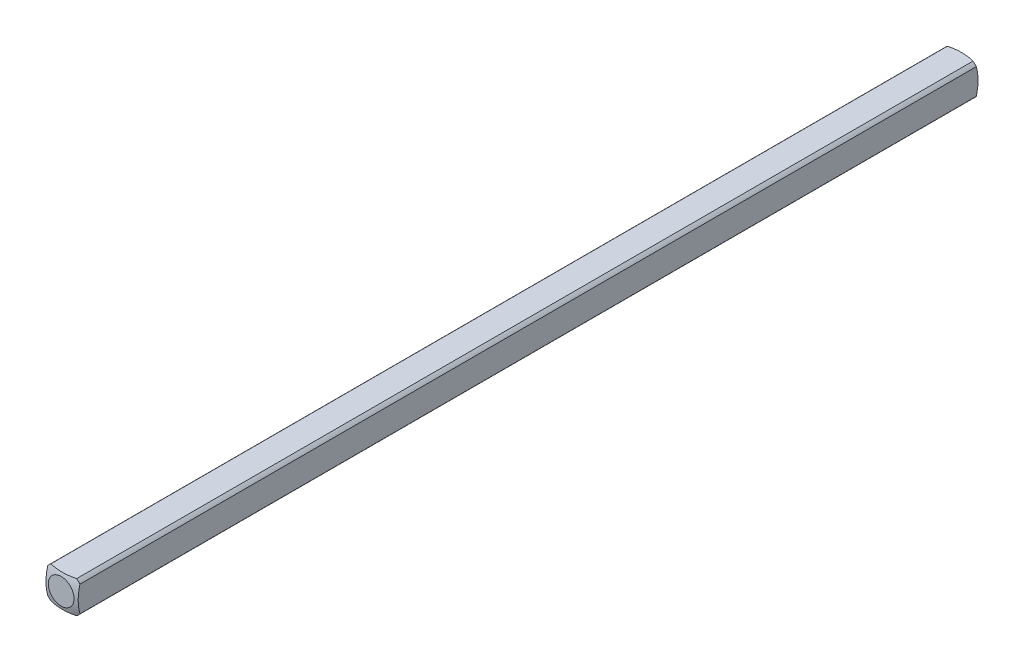
ISO-10303-21;
HEADER;
FILE_DESCRIPTION(('STEP AP214'),'2;1');
FILE_NAME('part.step','',(''),(''),'','','');
FILE_SCHEMA(('AUTOMOTIVE_DESIGN { 1 0 10303 214 1 1 1 1 }'));
ENDSEC;
DATA;
#1=APPLICATION_CONTEXT('core data for automotive mechanical design processes');
#2=APPLICATION_PROTOCOL_DEFINITION('international standard','automotive_design',2000,#1);
#3=PRODUCT_CONTEXT('',#1,'mechanical');
#4=PRODUCT('Part','Part','',(#3));
#5=PRODUCT_RELATED_PRODUCT_CATEGORY('part','',(#4));
#6=PRODUCT_DEFINITION_FORMATION('','',#4);
#7=PRODUCT_DEFINITION_CONTEXT('part definition',#1,'design');
#8=PRODUCT_DEFINITION('design','',#6,#7);
#9=PRODUCT_DEFINITION_SHAPE('','',#8);
#10=(LENGTH_UNIT() NAMED_UNIT(*) SI_UNIT(.MILLI.,.METRE.));
#11=(NAMED_UNIT(*) PLANE_ANGLE_UNIT() SI_UNIT($,.RADIAN.));
#12=(NAMED_UNIT(*) SI_UNIT($,.STERADIAN.) SOLID_ANGLE_UNIT());
#13=UNCERTAINTY_MEASURE_WITH_UNIT(LENGTH_MEASURE(1.E-05),#10,'distance_accuracy_value','');
#14=(GEOMETRIC_REPRESENTATION_CONTEXT(3) GLOBAL_UNCERTAINTY_ASSIGNED_CONTEXT((#13)) GLOBAL_UNIT_ASSIGNED_CONTEXT((#10,
#11,#12)) REPRESENTATION_CONTEXT('',''));
#15=CARTESIAN_POINT('',(0.,0.,0.));
#16=DIRECTION('',(0.,0.,1.));
#17=DIRECTION('',(1.,0.,0.));
#18=AXIS2_PLACEMENT_3D('',#15,#16,#17);
#19=CARTESIAN_POINT('',(-1.5875,-1.5875,44.45));
#20=DIRECTION('',(1.,0.,0.));
#21=DIRECTION('',(0.,0.,-1.));
#22=AXIS2_PLACEMENT_3D('',#19,#20,#21);
#23=PLANE('',#22);
#24=CARTESIAN_POINT('',(-1.5875,0.,4.91912226376204));
#25=DIRECTION('',(1.,0.,0.));
#26=DIRECTION('',(0.,0.,-1.));
#27=AXIS2_PLACEMENT_3D('',#24,#25,#26);
#28=CIRCLE('',#27,4.82558221875869);
#29=CARTESIAN_POINT('',(-1.5875,-1.26841150657032,0.263225357686904));
#30=VERTEX_POINT('',#29);
#31=CARTESIAN_POINT('',(-1.5875,1.26841150657032,0.263225357686907));
#32=VERTEX_POINT('',#31);
#33=EDGE_CURVE('E55',#30,#32,#28,.T.);
#34=ORIENTED_EDGE('',*,*,#33,.F.);
#35=DIRECTION('',(0.,0.,-1.));
#36=VECTOR('',#35,1.);
#37=CARTESIAN_POINT('',(-1.5875,-1.26841150657032,44.45));
#38=LINE('',#37,#36);
#39=CARTESIAN_POINT('',(-1.5875,-1.26841150657032,88.6367746423131));
#40=VERTEX_POINT('',#39);
#41=EDGE_CURVE('E48',#40,#30,#38,.T.);
#42=ORIENTED_EDGE('',*,*,#41,.F.);
#43=CARTESIAN_POINT('',(-1.5875,0.,83.980877736238));
#44=DIRECTION('',(-1.,0.,0.));
#45=DIRECTION('',(0.,0.,1.));
#46=AXIS2_PLACEMENT_3D('',#43,#44,#45);
#47=CIRCLE('',#46,4.82558221875869);
#48=CARTESIAN_POINT('',(-1.5875,1.26841150657032,88.6367746423131));
#49=VERTEX_POINT('',#48);
#50=EDGE_CURVE('E134',#40,#49,#47,.T.);
#51=ORIENTED_EDGE('',*,*,#50,.T.);
#52=DIRECTION('',(0.,0.,-1.));
#53=VECTOR('',#52,1.);
#54=CARTESIAN_POINT('',(-1.5875,1.26841150657032,44.45));
#55=LINE('',#54,#53);
#56=EDGE_CURVE('E120',#32,#49,#55,.F.);
#57=ORIENTED_EDGE('',*,*,#56,.F.);
#58=EDGE_LOOP('',(#34,#42,#51,#57));
#59=FACE_BOUND('',#58,.T.);
#60=ADVANCED_FACE('F40',(#59),#23,.F.);
#61=CARTESIAN_POINT('',(-1.5875,-1.5875,44.45));
#62=DIRECTION('',(0.,1.,0.));
#63=DIRECTION('',(0.,0.,1.));
#64=AXIS2_PLACEMENT_3D('',#61,#62,#63);
#65=PLANE('',#64);
#66=CARTESIAN_POINT('',(0.,-1.5875,4.91912226376204));
#67=DIRECTION('',(0.,1.,0.));
#68=DIRECTION('',(0.,0.,1.));
#69=AXIS2_PLACEMENT_3D('',#66,#67,#68);
#70=CIRCLE('',#69,4.82558221875869);
#71=CARTESIAN_POINT('',(1.26841150657032,-1.5875,0.263225357686905));
#72=VERTEX_POINT('',#71);
#73=CARTESIAN_POINT('',(-1.26841150657032,-1.5875,0.263225357686904));
#74=VERTEX_POINT('',#73);
#75=EDGE_CURVE('E175',#72,#74,#70,.T.);
#76=ORIENTED_EDGE('',*,*,#75,.F.);
#77=DIRECTION('',(0.,0.,-1.));
#78=VECTOR('',#77,1.);
#79=CARTESIAN_POINT('',(1.26841150657032,-1.5875,44.45));
#80=LINE('',#79,#78);
#81=CARTESIAN_POINT('',(1.26841150657032,-1.5875,88.6367746423131));
#82=VERTEX_POINT('',#81);
#83=EDGE_CURVE('E195',#82,#72,#80,.T.);
#84=ORIENTED_EDGE('',*,*,#83,.F.);
#85=CARTESIAN_POINT('',(0.,-1.5875,83.980877736238));
#86=DIRECTION('',(0.,-1.,0.));
#87=DIRECTION('',(0.,0.,-1.));
#88=AXIS2_PLACEMENT_3D('',#85,#86,#87);
#89=CIRCLE('',#88,4.82558221875869);
#90=CARTESIAN_POINT('',(-1.26841150657032,-1.5875,88.6367746423131));
#91=VERTEX_POINT('',#90);
#92=EDGE_CURVE('E149',#82,#91,#89,.T.);
#93=ORIENTED_EDGE('',*,*,#92,.T.);
#94=DIRECTION('',(0.,0.,-1.));
#95=VECTOR('',#94,1.);
#96=CARTESIAN_POINT('',(-1.26841150657032,-1.5875,44.45));
#97=LINE('',#96,#95);
#98=EDGE_CURVE('E192',#74,#91,#97,.F.);
#99=ORIENTED_EDGE('',*,*,#98,.F.);
#100=EDGE_LOOP('',(#76,#84,#93,#99));
#101=FACE_BOUND('',#100,.T.);
#102=ADVANCED_FACE('F208',(#101),#65,.F.);
#103=CARTESIAN_POINT('',(1.5875,-1.5875,44.45));
#104=DIRECTION('',(-1.,0.,0.));
#105=DIRECTION('',(0.,0.,1.));
#106=AXIS2_PLACEMENT_3D('',#103,#104,#105);
#107=PLANE('',#106);
#108=CARTESIAN_POINT('',(1.5875,0.,4.91912226376204));
#109=DIRECTION('',(-1.,0.,0.));
#110=DIRECTION('',(0.,0.,1.));
#111=AXIS2_PLACEMENT_3D('',#108,#109,#110);
#112=CIRCLE('',#111,4.82558221875869);
#113=CARTESIAN_POINT('',(1.5875,1.26841150657032,0.263225357686904));
#114=VERTEX_POINT('',#113);
#115=CARTESIAN_POINT('',(1.5875,-1.26841150657032,0.263225357686904));
#116=VERTEX_POINT('',#115);
#117=EDGE_CURVE('E172',#114,#116,#112,.T.);
#118=ORIENTED_EDGE('',*,*,#117,.F.);
#119=DIRECTION('',(0.,0.,-1.));
#120=VECTOR('',#119,1.);
#121=CARTESIAN_POINT('',(1.5875,1.26841150657032,44.45));
#122=LINE('',#121,#120);
#123=CARTESIAN_POINT('',(1.5875,1.26841150657032,88.6367746423131));
#124=VERTEX_POINT('',#123);
#125=EDGE_CURVE('E188',#124,#114,#122,.T.);
#126=ORIENTED_EDGE('',*,*,#125,.F.);
#127=CARTESIAN_POINT('',(1.5875,0.,83.980877736238));
#128=DIRECTION('',(1.,0.,0.));
#129=DIRECTION('',(0.,0.,-1.));
#130=AXIS2_PLACEMENT_3D('',#127,#128,#129);
#131=CIRCLE('',#130,4.82558221875869);
#132=CARTESIAN_POINT('',(1.5875,-1.26841150657032,88.6367746423131));
#133=VERTEX_POINT('',#132);
#134=EDGE_CURVE('E145',#124,#133,#131,.T.);
#135=ORIENTED_EDGE('',*,*,#134,.T.);
#136=DIRECTION('',(0.,0.,-1.));
#137=VECTOR('',#136,1.);
#138=CARTESIAN_POINT('',(1.5875,-1.26841150657032,44.45));
#139=LINE('',#138,#137);
#140=EDGE_CURVE('E113',#116,#133,#139,.F.);
#141=ORIENTED_EDGE('',*,*,#140,.F.);
#142=EDGE_LOOP('',(#118,#126,#135,#141));
#143=FACE_BOUND('',#142,.T.);
#144=ADVANCED_FACE('F215',(#143),#107,.F.);
#145=CARTESIAN_POINT('',(-1.5875,1.5875,44.45));
#146=DIRECTION('',(0.,-1.,0.));
#147=DIRECTION('',(0.,0.,-1.));
#148=AXIS2_PLACEMENT_3D('',#145,#146,#147);
#149=PLANE('',#148);
#150=CARTESIAN_POINT('',(0.,1.5875,4.91912226376204));
#151=DIRECTION('',(0.,-1.,0.));
#152=DIRECTION('',(0.,0.,-1.));
#153=AXIS2_PLACEMENT_3D('',#150,#151,#152);
#154=CIRCLE('',#153,4.82558221875869);
#155=CARTESIAN_POINT('',(-1.26841150657032,1.5875,0.263225357686904));
#156=VERTEX_POINT('',#155);
#157=CARTESIAN_POINT('',(1.26841150657032,1.5875,0.263225357686904));
#158=VERTEX_POINT('',#157);
#159=EDGE_CURVE('E110',#156,#158,#154,.T.);
#160=ORIENTED_EDGE('',*,*,#159,.F.);
#161=DIRECTION('',(0.,0.,-1.));
#162=VECTOR('',#161,1.);
#163=CARTESIAN_POINT('',(-1.26841150657032,1.5875,44.45));
#164=LINE('',#163,#162);
#165=CARTESIAN_POINT('',(-1.26841150657032,1.5875,88.6367746423131));
#166=VERTEX_POINT('',#165);
#167=EDGE_CURVE('E104',#166,#156,#164,.T.);
#168=ORIENTED_EDGE('',*,*,#167,.F.);
#169=CARTESIAN_POINT('',(0.,1.5875,83.980877736238));
#170=DIRECTION('',(0.,1.,0.));
#171=DIRECTION('',(0.,0.,1.));
#172=AXIS2_PLACEMENT_3D('',#169,#170,#171);
#173=CIRCLE('',#172,4.82558221875869);
#174=CARTESIAN_POINT('',(1.26841150657032,1.5875,88.6367746423131));
#175=VERTEX_POINT('',#174);
#176=EDGE_CURVE('E109',#166,#175,#173,.T.);
#177=ORIENTED_EDGE('',*,*,#176,.T.);
#178=DIRECTION('',(0.,0.,-1.));
#179=VECTOR('',#178,1.);
#180=CARTESIAN_POINT('',(1.26841150657032,1.5875,44.45));
#181=LINE('',#180,#179);
#182=EDGE_CURVE('E114',#158,#175,#181,.F.);
#183=ORIENTED_EDGE('',*,*,#182,.F.);
#184=EDGE_LOOP('',(#160,#168,#177,#183));
#185=FACE_BOUND('',#184,.T.);
#186=ADVANCED_FACE('F106',(#185),#149,.F.);
#187=CARTESIAN_POINT('',(0.,0.,44.45));
#188=DIRECTION('',(0.,0.,-1.));
#189=DIRECTION('',(-1.,0.,0.));
#190=AXIS2_PLACEMENT_3D('',#187,#188,#189);
#191=CYLINDRICAL_SURFACE('',#190,2.032);
#192=ORIENTED_EDGE('',*,*,#41,.T.);
#193=CARTESIAN_POINT('',(0.,0.,0.263225357686904));
#194=DIRECTION('',(0.,0.,1.));
#195=DIRECTION('',(1.,0.,0.));
#196=AXIS2_PLACEMENT_3D('',#193,#194,#195);
#197=CIRCLE('',#196,2.032);
#198=EDGE_CURVE('E168',#30,#74,#197,.T.);
#199=ORIENTED_EDGE('',*,*,#198,.T.);
#200=ORIENTED_EDGE('',*,*,#98,.T.);
#201=CARTESIAN_POINT('',(0.,0.,88.6367746423131));
#202=DIRECTION('',(0.,0.,1.));
#203=DIRECTION('',(1.,0.,0.));
#204=AXIS2_PLACEMENT_3D('',#201,#202,#203);
#205=CIRCLE('',#204,2.032);
#206=EDGE_CURVE('E141',#40,#91,#205,.T.);
#207=ORIENTED_EDGE('',*,*,#206,.F.);
#208=EDGE_LOOP('',(#192,#199,#200,#207));
#209=FACE_BOUND('',#208,.T.);
#210=ADVANCED_FACE('F204',(#209),#191,.T.);
#211=ORIENTED_EDGE('',*,*,#83,.T.);
#212=CARTESIAN_POINT('',(0.,0.,0.263225357686904));
#213=DIRECTION('',(0.,0.,1.));
#214=DIRECTION('',(1.,0.,0.));
#215=AXIS2_PLACEMENT_3D('',#212,#213,#214);
#216=CIRCLE('',#215,2.032);
#217=EDGE_CURVE('E61',#72,#116,#216,.T.);
#218=ORIENTED_EDGE('',*,*,#217,.T.);
#219=ORIENTED_EDGE('',*,*,#140,.T.);
#220=CARTESIAN_POINT('',(0.,0.,88.6367746423131));
#221=DIRECTION('',(0.,0.,1.));
#222=DIRECTION('',(1.,0.,0.));
#223=AXIS2_PLACEMENT_3D('',#220,#221,#222);
#224=CIRCLE('',#223,2.032);
#225=EDGE_CURVE('E153',#82,#133,#224,.T.);
#226=ORIENTED_EDGE('',*,*,#225,.F.);
#227=EDGE_LOOP('',(#211,#218,#219,#226));
#228=FACE_BOUND('',#227,.T.);
#229=ADVANCED_FACE('F211',(#228),#191,.T.);
#230=ORIENTED_EDGE('',*,*,#125,.T.);
#231=CARTESIAN_POINT('',(0.,0.,0.263225357686904));
#232=DIRECTION('',(0.,0.,1.));
#233=DIRECTION('',(1.,0.,0.));
#234=AXIS2_PLACEMENT_3D('',#231,#232,#233);
#235=CIRCLE('',#234,2.032);
#236=EDGE_CURVE('E164',#114,#158,#235,.T.);
#237=ORIENTED_EDGE('',*,*,#236,.T.);
#238=ORIENTED_EDGE('',*,*,#182,.T.);
#239=CARTESIAN_POINT('',(0.,0.,88.6367746423131));
#240=DIRECTION('',(0.,0.,1.));
#241=DIRECTION('',(1.,0.,0.));
#242=AXIS2_PLACEMENT_3D('',#239,#240,#241);
#243=CIRCLE('',#242,2.032);
#244=EDGE_CURVE('E132',#124,#175,#243,.T.);
#245=ORIENTED_EDGE('',*,*,#244,.F.);
#246=EDGE_LOOP('',(#230,#237,#238,#245));
#247=FACE_BOUND('',#246,.T.);
#248=ADVANCED_FACE('F217',(#247),#191,.T.);
#249=ORIENTED_EDGE('',*,*,#167,.T.);
#250=CARTESIAN_POINT('',(0.,0.,0.263225357686904));
#251=DIRECTION('',(0.,0.,1.));
#252=DIRECTION('',(1.,0.,0.));
#253=AXIS2_PLACEMENT_3D('',#250,#251,#252);
#254=CIRCLE('',#253,2.032);
#255=EDGE_CURVE('E12',#156,#32,#254,.T.);
#256=ORIENTED_EDGE('',*,*,#255,.T.);
#257=ORIENTED_EDGE('',*,*,#56,.T.);
#258=CARTESIAN_POINT('',(0.,0.,88.6367746423131));
#259=DIRECTION('',(0.,0.,1.));
#260=DIRECTION('',(1.,0.,0.));
#261=AXIS2_PLACEMENT_3D('',#258,#259,#260);
#262=CIRCLE('',#261,2.032);
#263=EDGE_CURVE('E117',#166,#49,#262,.T.);
#264=ORIENTED_EDGE('',*,*,#263,.F.);
#265=EDGE_LOOP('',(#249,#256,#257,#264));
#266=FACE_BOUND('',#265,.T.);
#267=ADVANCED_FACE('F118',(#266),#191,.T.);
#268=CARTESIAN_POINT('',(0.,0.,4.91912226376204));
#269=DIRECTION('',(0.,0.,1.));
#270=DIRECTION('',(-1.,0.,0.));
#271=AXIS2_PLACEMENT_3D('',#268,#269,#270);
#272=SPHERICAL_SURFACE('',#271,5.08);
#273=CARTESIAN_POINT('',(0.,0.,0.));
#274=DIRECTION('',(0.,0.,-1.));
#275=DIRECTION('',(-1.,0.,0.));
#276=AXIS2_PLACEMENT_3D('',#273,#274,#275);
#277=CIRCLE('',#276,1.26832020963187);
#278=CARTESIAN_POINT('',(-1.26832020963187,0.,0.));
#279=VERTEX_POINT('',#278);
#280=EDGE_CURVE('E180',#279,#279,#277,.T.);
#281=ORIENTED_EDGE('',*,*,#280,.F.);
#282=EDGE_LOOP('',(#281));
#283=FACE_BOUND('',#282,.T.);
#284=ORIENTED_EDGE('',*,*,#75,.T.);
#285=ORIENTED_EDGE('',*,*,#198,.F.);
#286=ORIENTED_EDGE('',*,*,#33,.T.);
#287=ORIENTED_EDGE('',*,*,#255,.F.);
#288=ORIENTED_EDGE('',*,*,#159,.T.);
#289=ORIENTED_EDGE('',*,*,#236,.F.);
#290=ORIENTED_EDGE('',*,*,#117,.T.);
#291=ORIENTED_EDGE('',*,*,#217,.F.);
#292=EDGE_LOOP('',(#284,#285,#286,#287,#288,#289,#290,#291));
#293=FACE_BOUND('',#292,.T.);
#294=ADVANCED_FACE('F218',(#283,#293),#272,.T.);
#295=CARTESIAN_POINT('',(0.,0.,0.));
#296=DIRECTION('',(0.,0.,-1.));
#297=DIRECTION('',(-1.,0.,0.));
#298=AXIS2_PLACEMENT_3D('',#295,#296,#297);
#299=PLANE('',#298);
#300=ORIENTED_EDGE('',*,*,#280,.T.);
#301=EDGE_LOOP('',(#300));
#302=FACE_BOUND('',#301,.T.);
#303=ADVANCED_FACE('F220',(#302),#299,.T.);
#304=CARTESIAN_POINT('',(0.,0.,83.980877736238));
#305=DIRECTION('',(0.,0.,-1.));
#306=DIRECTION('',(-1.,0.,0.));
#307=AXIS2_PLACEMENT_3D('',#304,#305,#306);
#308=SPHERICAL_SURFACE('',#307,5.08);
#309=CARTESIAN_POINT('',(0.,0.,88.9));
#310=DIRECTION('',(0.,0.,-1.));
#311=DIRECTION('',(-1.,0.,0.));
#312=AXIS2_PLACEMENT_3D('',#309,#310,#311);
#313=CIRCLE('',#312,1.26832020963187);
#314=CARTESIAN_POINT('',(-1.26832020963187,0.,88.9));
#315=VERTEX_POINT('',#314);
#316=EDGE_CURVE('E125',#315,#315,#313,.T.);
#317=ORIENTED_EDGE('',*,*,#316,.T.);
#318=EDGE_LOOP('',(#317));
#319=FACE_BOUND('',#318,.T.);
#320=ORIENTED_EDGE('',*,*,#92,.F.);
#321=ORIENTED_EDGE('',*,*,#225,.T.);
#322=ORIENTED_EDGE('',*,*,#134,.F.);
#323=ORIENTED_EDGE('',*,*,#244,.T.);
#324=ORIENTED_EDGE('',*,*,#176,.F.);
#325=ORIENTED_EDGE('',*,*,#263,.T.);
#326=ORIENTED_EDGE('',*,*,#50,.F.);
#327=ORIENTED_EDGE('',*,*,#206,.T.);
#328=EDGE_LOOP('',(#320,#321,#322,#323,#324,#325,#326,#327));
#329=FACE_BOUND('',#328,.T.);
#330=ADVANCED_FACE('F129',(#319,#329),#308,.T.);
#331=CARTESIAN_POINT('',(0.,0.,88.9));
#332=DIRECTION('',(0.,0.,1.));
#333=DIRECTION('',(-1.,0.,0.));
#334=AXIS2_PLACEMENT_3D('',#331,#332,#333);
#335=PLANE('',#334);
#336=ORIENTED_EDGE('',*,*,#316,.F.);
#337=EDGE_LOOP('',(#336));
#338=FACE_BOUND('',#337,.T.);
#339=ADVANCED_FACE('F265',(#338),#335,.T.);
#340=CLOSED_SHELL('',(#60,#102,#144,#186,#210,#229,#248,#267,#294,#303,#330,#339));
#341=MANIFOLD_SOLID_BREP('B2',#340);
#342=ADVANCED_BREP_SHAPE_REPRESENTATION('',(#18,#341),#14);
#343=SHAPE_DEFINITION_REPRESENTATION(#9,#342);
ENDSEC;
END-ISO-10303-21;
